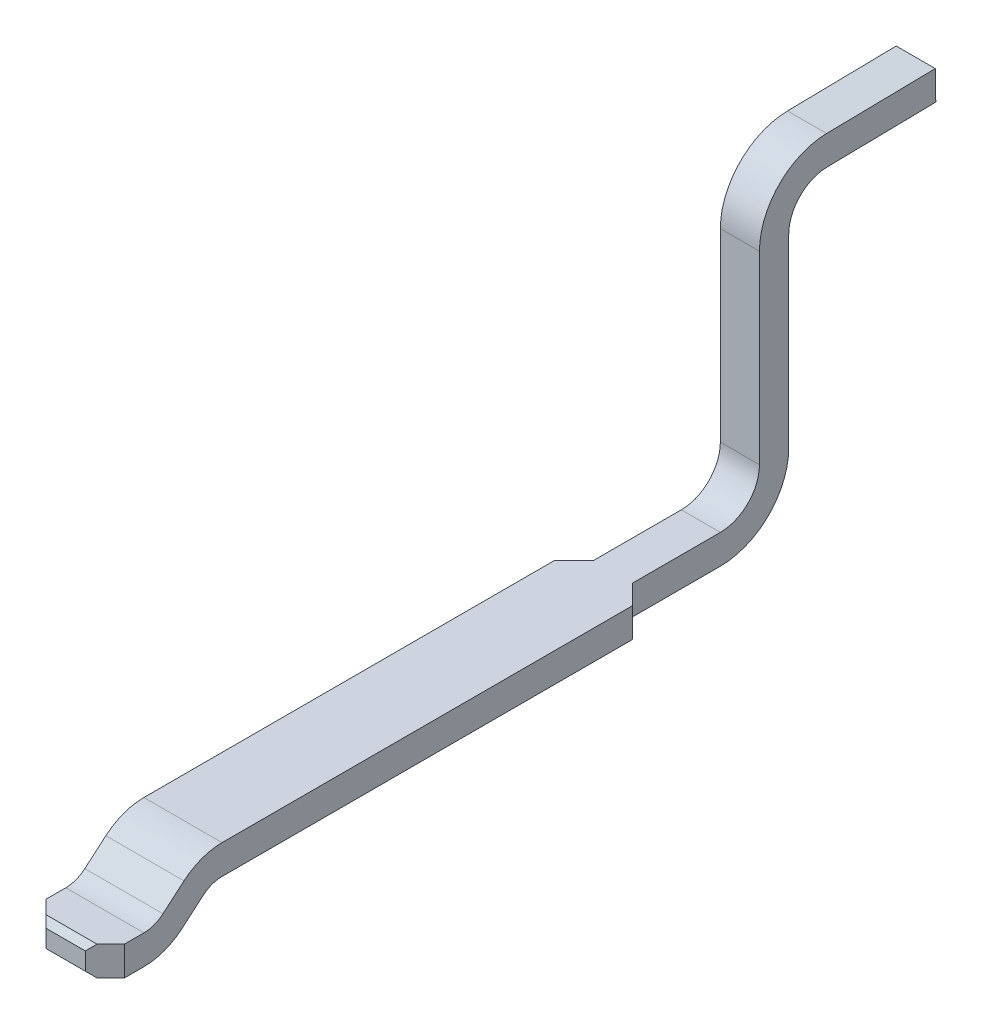
ISO-10303-21;
HEADER;
FILE_DESCRIPTION(('STEP AP214'),'2;1');
FILE_NAME('part.step','',(''),(''),'','','');
FILE_SCHEMA(('AUTOMOTIVE_DESIGN { 1 0 10303 214 1 1 1 1 }'));
ENDSEC;
DATA;
#1=APPLICATION_CONTEXT('core data for automotive mechanical design processes');
#2=APPLICATION_PROTOCOL_DEFINITION('international standard','automotive_design',2000,#1);
#3=PRODUCT_CONTEXT('',#1,'mechanical');
#4=PRODUCT('Part','Part','',(#3));
#5=PRODUCT_RELATED_PRODUCT_CATEGORY('part','',(#4));
#6=PRODUCT_DEFINITION_FORMATION('','',#4);
#7=PRODUCT_DEFINITION_CONTEXT('part definition',#1,'design');
#8=PRODUCT_DEFINITION('design','',#6,#7);
#9=PRODUCT_DEFINITION_SHAPE('','',#8);
#10=(LENGTH_UNIT() NAMED_UNIT(*) SI_UNIT(.MILLI.,.METRE.));
#11=(NAMED_UNIT(*) PLANE_ANGLE_UNIT() SI_UNIT($,.RADIAN.));
#12=(NAMED_UNIT(*) SI_UNIT($,.STERADIAN.) SOLID_ANGLE_UNIT());
#13=UNCERTAINTY_MEASURE_WITH_UNIT(LENGTH_MEASURE(1.E-05),#10,'distance_accuracy_value','');
#14=(GEOMETRIC_REPRESENTATION_CONTEXT(3) GLOBAL_UNCERTAINTY_ASSIGNED_CONTEXT((#13)) GLOBAL_UNIT_ASSIGNED_CONTEXT((#10,
#11,#12)) REPRESENTATION_CONTEXT('',''));
#15=CARTESIAN_POINT('',(0.,0.,0.));
#16=DIRECTION('',(0.,0.,1.));
#17=DIRECTION('',(1.,0.,0.));
#18=AXIS2_PLACEMENT_3D('',#15,#16,#17);
#19=CARTESIAN_POINT('',(2.50403496496787,8.074228109921,4.324047830079));
#20=DIRECTION('',(0.,0.707106781186548,0.707106781186548));
#21=DIRECTION('',(0.,-0.707106781186548,0.707106781186548));
#22=AXIS2_PLACEMENT_3D('',#19,#20,#21);
#23=PLANE('',#22);
#24=DIRECTION('',(-0.577350269190038,0.577350269189612,-0.577350269189228));
#25=VECTOR('',#24,1.);
#26=CARTESIAN_POINT('',(2.53973309999994,8.04019892,4.35807701999993));
#27=LINE('',#26,#25);
#28=CARTESIAN_POINT('',(2.53973309999992,8.04019892,4.35807701999995));
#29=VERTEX_POINT('',#28);
#30=CARTESIAN_POINT('',(2.50973309999989,8.07019892,4.32807701999998));
#31=VERTEX_POINT('',#30);
#32=EDGE_CURVE('E279',#29,#31,#27,.T.);
#33=ORIENTED_EDGE('',*,*,#32,.F.);
#34=DIRECTION('',(-1.,0.,0.));
#35=VECTOR('',#34,1.);
#36=CARTESIAN_POINT('',(2.74543123503187,8.04019892,4.35807702));
#37=LINE('',#36,#35);
#38=CARTESIAN_POINT('',(2.73973309999986,8.04019892,4.35807701999999));
#39=VERTEX_POINT('',#38);
#40=EDGE_CURVE('E356',#29,#39,#37,.F.);
#41=ORIENTED_EDGE('',*,*,#40,.T.);
#42=DIRECTION('',(-0.577350269190038,-0.577350269189604,0.577350269189236));
#43=VECTOR('',#42,1.);
#44=CARTESIAN_POINT('',(2.76973309999988,8.07019892,4.32807702000001));
#45=LINE('',#44,#43);
#46=CARTESIAN_POINT('',(2.76973309999988,8.07019892,4.32807702000001));
#47=VERTEX_POINT('',#46);
#48=EDGE_CURVE('E269',#47,#39,#45,.T.);
#49=ORIENTED_EDGE('',*,*,#48,.F.);
#50=DIRECTION('',(1.,0.,0.));
#51=VECTOR('',#50,1.);
#52=CARTESIAN_POINT('',(2.84773309999987,8.07019892,4.32807702));
#53=LINE('',#52,#51);
#54=EDGE_CURVE('E276',#31,#47,#53,.T.);
#55=ORIENTED_EDGE('',*,*,#54,.F.);
#56=EDGE_LOOP('',(#33,#41,#49,#55));
#57=FACE_BOUND('',#56,.T.);
#58=ADVANCED_FACE('F17',(#57),#23,.T.);
#59=CARTESIAN_POINT('',(2.74543123503187,7.944500784968,4.35807702));
#60=DIRECTION('',(0.,0.,-1.));
#61=DIRECTION('',(-1.,0.,0.));
#62=AXIS2_PLACEMENT_3D('',#59,#60,#61);
#63=PLANE('',#62);
#64=DIRECTION('',(0.,1.,0.));
#65=VECTOR('',#64,1.);
#66=CARTESIAN_POINT('',(2.73973309999986,7.914500784968,4.35807701999999));
#67=LINE('',#66,#65);
#68=CARTESIAN_POINT('',(2.73973309999986,7.95019892,4.35807701999999));
#69=VERTEX_POINT('',#68);
#70=EDGE_CURVE('E256',#39,#69,#67,.F.);
#71=ORIENTED_EDGE('',*,*,#70,.F.);
#72=ORIENTED_EDGE('',*,*,#40,.F.);
#73=DIRECTION('',(0.,1.,0.));
#74=VECTOR('',#73,1.);
#75=CARTESIAN_POINT('',(2.53973309999994,7.914500784968,4.35807701999993));
#76=LINE('',#75,#74);
#77=CARTESIAN_POINT('',(2.53973309999992,7.95019892,4.35807701999995));
#78=VERTEX_POINT('',#77);
#79=EDGE_CURVE('E338',#78,#29,#76,.T.);
#80=ORIENTED_EDGE('',*,*,#79,.F.);
#81=DIRECTION('',(1.,0.,0.));
#82=VECTOR('',#81,1.);
#83=CARTESIAN_POINT('',(2.77543123503187,7.95019892,4.35807702));
#84=LINE('',#83,#82);
#85=EDGE_CURVE('E331',#69,#78,#84,.F.);
#86=ORIENTED_EDGE('',*,*,#85,.F.);
#87=EDGE_LOOP('',(#71,#72,#80,#86));
#88=FACE_BOUND('',#87,.T.);
#89=ADVANCED_FACE('F775',(#88),#63,.F.);
#90=CARTESIAN_POINT('',(2.77543123503187,7.916169730079,4.324047830079));
#91=DIRECTION('',(0.,-0.707106781186548,0.707106781186548));
#92=DIRECTION('',(0.,-0.707106781186548,-0.707106781186548));
#93=AXIS2_PLACEMENT_3D('',#90,#91,#92);
#94=PLANE('',#93);
#95=DIRECTION('',(0.577350269190026,-0.577350269189626,-0.577350269189225));
#96=VECTOR('',#95,1.);
#97=CARTESIAN_POINT('',(2.73973309999986,7.95019892,4.35807701999999));
#98=LINE('',#97,#96);
#99=CARTESIAN_POINT('',(2.76973309999987,7.92019892,4.32807702));
#100=VERTEX_POINT('',#99);
#101=EDGE_CURVE('E270',#69,#100,#98,.T.);
#102=ORIENTED_EDGE('',*,*,#101,.F.);
#103=ORIENTED_EDGE('',*,*,#85,.T.);
#104=DIRECTION('',(0.577350269190026,0.577350269189634,0.577350269189217));
#105=VECTOR('',#104,1.);
#106=CARTESIAN_POINT('',(2.50973309999992,7.92019892,4.32807701999995));
#107=LINE('',#106,#105);
#108=CARTESIAN_POINT('',(2.50973309999989,7.92019892,4.32807701999998));
#109=VERTEX_POINT('',#108);
#110=EDGE_CURVE('E309',#109,#78,#107,.T.);
#111=ORIENTED_EDGE('',*,*,#110,.F.);
#112=DIRECTION('',(1.,0.,0.));
#113=VECTOR('',#112,1.);
#114=CARTESIAN_POINT('',(2.84773309999987,7.92019892,4.32807702));
#115=LINE('',#114,#113);
#116=EDGE_CURVE('E252',#109,#100,#115,.T.);
#117=ORIENTED_EDGE('',*,*,#116,.T.);
#118=EDGE_LOOP('',(#102,#103,#111,#117));
#119=FACE_BOUND('',#118,.T.);
#120=ADVANCED_FACE('F768',(#119),#94,.T.);
#121=CARTESIAN_POINT('',(2.74543123503187,8.45127780084181,0.758077020000001));
#122=DIRECTION('',(0.,0.,-1.));
#123=DIRECTION('',(-1.,0.,0.));
#124=AXIS2_PLACEMENT_3D('',#121,#122,#123);
#125=PLANE('',#124);
#126=DIRECTION('',(0.,1.,0.));
#127=VECTOR('',#126,1.);
#128=CARTESIAN_POINT('',(2.73973309999987,9.610333059471,0.758077020000001));
#129=LINE('',#128,#127);
#130=CARTESIAN_POINT('',(2.73973309999987,8.47019892,0.758077020000001));
#131=VERTEX_POINT('',#130);
#132=CARTESIAN_POINT('',(2.73973309999987,9.41625487791,0.758077020000001));
#133=VERTEX_POINT('',#132);
#134=EDGE_CURVE('E416',#131,#133,#129,.T.);
#135=ORIENTED_EDGE('',*,*,#134,.F.);
#136=DIRECTION('',(-1.,0.,0.));
#137=VECTOR('',#136,1.);
#138=CARTESIAN_POINT('',(2.73973309999987,8.47019892,0.75807702));
#139=LINE('',#138,#137);
#140=CARTESIAN_POINT('',(2.53973309999987,8.47019892,0.758077020000001));
#141=VERTEX_POINT('',#140);
#142=EDGE_CURVE('E213',#141,#131,#139,.F.);
#143=ORIENTED_EDGE('',*,*,#142,.F.);
#144=DIRECTION('',(0.,1.,0.));
#145=VECTOR('',#144,1.);
#146=CARTESIAN_POINT('',(2.53973309999987,8.45127780084181,0.758077020000001));
#147=LINE('',#146,#145);
#148=CARTESIAN_POINT('',(2.53973309999987,9.41625487791,0.758077020000001));
#149=VERTEX_POINT('',#148);
#150=EDGE_CURVE('E412',#149,#141,#147,.F.);
#151=ORIENTED_EDGE('',*,*,#150,.F.);
#152=DIRECTION('',(1.,0.,0.));
#153=VECTOR('',#152,1.);
#154=CARTESIAN_POINT('',(2.53973309999987,9.41625487791,0.758077020000001));
#155=LINE('',#154,#153);
#156=EDGE_CURVE('E306',#149,#133,#155,.T.);
#157=ORIENTED_EDGE('',*,*,#156,.T.);
#158=EDGE_LOOP('',(#135,#143,#151,#157));
#159=FACE_BOUND('',#158,.T.);
#160=ADVANCED_FACE('F579',(#159),#125,.T.);
#161=CARTESIAN_POINT('',(2.73973309999987,8.47019892,1.10807702));
#162=DIRECTION('',(-1.,0.,0.));
#163=DIRECTION('',(0.,0.,1.));
#164=AXIS2_PLACEMENT_3D('',#161,#162,#163);
#165=CYLINDRICAL_SURFACE('',#164,0.35);
#166=DIRECTION('',(1.,0.,0.));
#167=VECTOR('',#166,1.);
#168=CARTESIAN_POINT('',(2.84773309999987,8.12019892,1.10807702));
#169=LINE('',#168,#167);
#170=CARTESIAN_POINT('',(2.73973309999987,8.12019892,1.10807702));
#171=VERTEX_POINT('',#170);
#172=CARTESIAN_POINT('',(2.53973309999987,8.12019892,1.10807702));
#173=VERTEX_POINT('',#172);
#174=EDGE_CURVE('E229',#171,#173,#169,.F.);
#175=ORIENTED_EDGE('',*,*,#174,.T.);
#176=CARTESIAN_POINT('',(2.53973309999987,8.47019892,1.10807702));
#177=DIRECTION('',(-1.,0.,0.));
#178=DIRECTION('',(0.,0.,1.));
#179=AXIS2_PLACEMENT_3D('',#176,#177,#178);
#180=CIRCLE('',#179,0.35);
#181=EDGE_CURVE('E409',#141,#173,#180,.T.);
#182=ORIENTED_EDGE('',*,*,#181,.F.);
#183=ORIENTED_EDGE('',*,*,#142,.T.);
#184=CARTESIAN_POINT('',(2.73973309999987,8.47019892,1.10807702));
#185=DIRECTION('',(-1.,0.,0.));
#186=DIRECTION('',(0.,0.,1.));
#187=AXIS2_PLACEMENT_3D('',#184,#185,#186);
#188=CIRCLE('',#187,0.35);
#189=EDGE_CURVE('E417',#171,#131,#188,.F.);
#190=ORIENTED_EDGE('',*,*,#189,.F.);
#191=EDGE_LOOP('',(#175,#182,#183,#190));
#192=FACE_BOUND('',#191,.T.);
#193=ADVANCED_FACE('F576',(#192),#165,.T.);
#194=CARTESIAN_POINT('',(2.74543123503187,8.45127780084181,0.908077020000001));
#195=DIRECTION('',(0.,0.,-1.));
#196=DIRECTION('',(-1.,0.,0.));
#197=AXIS2_PLACEMENT_3D('',#194,#195,#196);
#198=PLANE('',#197);
#199=DIRECTION('',(-1.,0.,0.));
#200=VECTOR('',#199,1.);
#201=CARTESIAN_POINT('',(2.73973309999987,8.47019892,0.90807702));
#202=LINE('',#201,#200);
#203=CARTESIAN_POINT('',(2.53973309999987,8.47019892,0.908077020000001));
#204=VERTEX_POINT('',#203);
#205=CARTESIAN_POINT('',(2.73973309999987,8.47019892,0.908077020000001));
#206=VERTEX_POINT('',#205);
#207=EDGE_CURVE('E218',#204,#206,#202,.F.);
#208=ORIENTED_EDGE('',*,*,#207,.T.);
#209=DIRECTION('',(0.,1.,0.));
#210=VECTOR('',#209,1.);
#211=CARTESIAN_POINT('',(2.73973309999987,9.610333059471,0.908077020000001));
#212=LINE('',#211,#210);
#213=CARTESIAN_POINT('',(2.73973309999987,9.41625487791,0.908077020000001));
#214=VERTEX_POINT('',#213);
#215=EDGE_CURVE('E216',#214,#206,#212,.F.);
#216=ORIENTED_EDGE('',*,*,#215,.F.);
#217=DIRECTION('',(1.,0.,0.));
#218=VECTOR('',#217,1.);
#219=CARTESIAN_POINT('',(2.53973309999987,9.41625487791,0.908077020000001));
#220=LINE('',#219,#218);
#221=CARTESIAN_POINT('',(2.53973309999987,9.41625487791,0.908077020000001));
#222=VERTEX_POINT('',#221);
#223=EDGE_CURVE('E203',#222,#214,#220,.T.);
#224=ORIENTED_EDGE('',*,*,#223,.F.);
#225=DIRECTION('',(0.,1.,0.));
#226=VECTOR('',#225,1.);
#227=CARTESIAN_POINT('',(2.53973309999987,8.45127780084181,0.908077020000001));
#228=LINE('',#227,#226);
#229=EDGE_CURVE('E404',#204,#222,#228,.T.);
#230=ORIENTED_EDGE('',*,*,#229,.F.);
#231=EDGE_LOOP('',(#208,#216,#224,#230));
#232=FACE_BOUND('',#231,.T.);
#233=ADVANCED_FACE('F217',(#232),#198,.F.);
#234=CARTESIAN_POINT('',(2.53973309999987,9.41625487791,0.558077020000001));
#235=DIRECTION('',(1.,0.,0.));
#236=DIRECTION('',(0.,0.,-1.));
#237=AXIS2_PLACEMENT_3D('',#234,#235,#236);
#238=CYLINDRICAL_SURFACE('',#237,0.35);
#239=ORIENTED_EDGE('',*,*,#223,.T.);
#240=CARTESIAN_POINT('',(2.73973309999987,9.41625487791,0.558077020000001));
#241=DIRECTION('',(1.,0.,0.));
#242=DIRECTION('',(0.,0.,-1.));
#243=AXIS2_PLACEMENT_3D('',#240,#241,#242);
#244=CIRCLE('',#243,0.35);
#245=CARTESIAN_POINT('',(2.73973309999987,9.76620157121429,0.564185362253241));
#246=VERTEX_POINT('',#245);
#247=EDGE_CURVE('E20',#246,#214,#244,.T.);
#248=ORIENTED_EDGE('',*,*,#247,.F.);
#249=DIRECTION('',(1.,0.,0.));
#250=VECTOR('',#249,1.);
#251=CARTESIAN_POINT('',(2.53403496496787,9.76620157121458,0.564185362253011));
#252=LINE('',#251,#250);
#253=CARTESIAN_POINT('',(2.53973309999987,9.76620157121429,0.564185362253241));
#254=VERTEX_POINT('',#253);
#255=EDGE_CURVE('E198',#254,#246,#252,.T.);
#256=ORIENTED_EDGE('',*,*,#255,.F.);
#257=CARTESIAN_POINT('',(2.53973309999987,9.41625487791,0.558077020000001));
#258=DIRECTION('',(1.,0.,0.));
#259=DIRECTION('',(0.,0.,-1.));
#260=AXIS2_PLACEMENT_3D('',#257,#258,#259);
#261=CIRCLE('',#260,0.35);
#262=EDGE_CURVE('E209',#222,#254,#261,.F.);
#263=ORIENTED_EDGE('',*,*,#262,.F.);
#264=EDGE_LOOP('',(#239,#248,#256,#263));
#265=FACE_BOUND('',#264,.T.);
#266=ADVANCED_FACE('F205',(#265),#238,.T.);
#267=CARTESIAN_POINT('',(2.53403496496787,9.766007480923,0.575304787611001));
#268=DIRECTION('',(0.,0.999847695156406,0.0174524064364471));
#269=DIRECTION('',(0.,-0.0174524064364471,0.999847695156406));
#270=AXIS2_PLACEMENT_3D('',#267,#268,#269);
#271=PLANE('',#270);
#272=DIRECTION('',(0.,0.0174524064385203,-0.99984769515637));
#273=VECTOR('',#272,1.);
#274=CARTESIAN_POINT('',(2.53973309999987,9.766201571214,0.564185362253001));
#275=LINE('',#274,#273);
#276=CARTESIAN_POINT('',(2.53973309999987,9.775906085794,0.00821409435916126));
#277=VERTEX_POINT('',#276);
#278=EDGE_CURVE('E318',#254,#277,#275,.T.);
#279=ORIENTED_EDGE('',*,*,#278,.F.);
#280=ORIENTED_EDGE('',*,*,#255,.T.);
#281=DIRECTION('',(0.,-0.0174524064385203,0.99984769515637));
#282=VECTOR('',#281,1.);
#283=CARTESIAN_POINT('',(2.73973309999987,9.775906085794,0.00821409435900074));
#284=LINE('',#283,#282);
#285=CARTESIAN_POINT('',(2.73973309999987,9.775906085794,0.00821409435916126));
#286=VERTEX_POINT('',#285);
#287=EDGE_CURVE('E226',#286,#246,#284,.T.);
#288=ORIENTED_EDGE('',*,*,#287,.F.);
#289=DIRECTION('',(1.,0.,0.));
#290=VECTOR('',#289,1.);
#291=CARTESIAN_POINT('',(2.74543123503187,9.77590608579399,0.0082140943594823));
#292=LINE('',#291,#290);
#293=EDGE_CURVE('E311',#277,#286,#292,.T.);
#294=ORIENTED_EDGE('',*,*,#293,.F.);
#295=EDGE_LOOP('',(#279,#280,#288,#294));
#296=FACE_BOUND('',#295,.T.);
#297=ADVANCED_FACE('F593',(#296),#271,.T.);
#298=CARTESIAN_POINT('',(2.74543123503187,9.620231664342,0.00549678722500089));
#299=DIRECTION('',(0.,0.0174524064396861,-0.999847695156349));
#300=DIRECTION('',(0.,0.999847695156349,0.0174524064396861));
#301=AXIS2_PLACEMENT_3D('',#298,#299,#300);
#302=PLANE('',#301);
#303=DIRECTION('',(1.,0.,0.));
#304=VECTOR('',#303,1.);
#305=CARTESIAN_POINT('',(2.53403496496787,9.62592893152041,0.00559623339400797));
#306=LINE('',#305,#304);
#307=CARTESIAN_POINT('',(2.73973309999987,9.62592893152018,0.00559623339400417));
#308=VERTEX_POINT('',#307);
#309=CARTESIAN_POINT('',(2.53973309999987,9.62592893152014,0.00559623339400334));
#310=VERTEX_POINT('',#309);
#311=EDGE_CURVE('E307',#308,#310,#306,.F.);
#312=ORIENTED_EDGE('',*,*,#311,.T.);
#313=DIRECTION('',(0.,-0.999847695156461,-0.0174524064332696));
#314=VECTOR('',#313,1.);
#315=CARTESIAN_POINT('',(2.53973309999987,9.775906085794,0.00821409435900074));
#316=LINE('',#315,#314);
#317=EDGE_CURVE('E314',#277,#310,#316,.T.);
#318=ORIENTED_EDGE('',*,*,#317,.F.);
#319=ORIENTED_EDGE('',*,*,#293,.T.);
#320=DIRECTION('',(0.,0.999847695156461,0.0174524064332696));
#321=VECTOR('',#320,1.);
#322=CARTESIAN_POINT('',(2.73973309999987,9.62592893152,0.00559623339400103));
#323=LINE('',#322,#321);
#324=EDGE_CURVE('E328',#308,#286,#323,.T.);
#325=ORIENTED_EDGE('',*,*,#324,.F.);
#326=EDGE_LOOP('',(#312,#318,#319,#325));
#327=FACE_BOUND('',#326,.T.);
#328=ADVANCED_FACE('F592',(#327),#302,.T.);
#329=CARTESIAN_POINT('',(2.53403496496787,9.616030326649,0.572686926645001));
#330=DIRECTION('',(0.,0.999847695156375,0.0174524064382066));
#331=DIRECTION('',(0.,-0.0174524064382066,0.999847695156375));
#332=AXIS2_PLACEMENT_3D('',#329,#330,#331);
#333=PLANE('',#332);
#334=DIRECTION('',(1.,0.,0.));
#335=VECTOR('',#334,1.);
#336=CARTESIAN_POINT('',(2.53973309999987,9.61622441694128,0.561567501287006));
#337=LINE('',#336,#335);
#338=CARTESIAN_POINT('',(2.73973309999987,9.61622441694114,0.561567501287176));
#339=VERTEX_POINT('',#338);
#340=CARTESIAN_POINT('',(2.53973309999987,9.61622441694114,0.561567501287176));
#341=VERTEX_POINT('',#340);
#342=EDGE_CURVE('E304',#339,#341,#337,.F.);
#343=ORIENTED_EDGE('',*,*,#342,.T.);
#344=DIRECTION('',(0.,-0.0174524064367521,0.999847695156401));
#345=VECTOR('',#344,1.);
#346=CARTESIAN_POINT('',(2.53973309999987,9.62592893152,0.00559623339400103));
#347=LINE('',#346,#345);
#348=EDGE_CURVE('E317',#310,#341,#347,.T.);
#349=ORIENTED_EDGE('',*,*,#348,.F.);
#350=ORIENTED_EDGE('',*,*,#311,.F.);
#351=DIRECTION('',(0.,0.0174524064367521,-0.999847695156401));
#352=VECTOR('',#351,1.);
#353=CARTESIAN_POINT('',(2.73973309999987,9.616224416941,0.561567501287001));
#354=LINE('',#353,#352);
#355=EDGE_CURVE('E333',#339,#308,#354,.T.);
#356=ORIENTED_EDGE('',*,*,#355,.F.);
#357=EDGE_LOOP('',(#343,#349,#350,#356));
#358=FACE_BOUND('',#357,.T.);
#359=ADVANCED_FACE('F588',(#358),#333,.F.);
#360=CARTESIAN_POINT('',(2.53973309999987,9.41625487791,0.558077020000001));
#361=DIRECTION('',(1.,0.,0.));
#362=DIRECTION('',(0.,0.,-1.));
#363=AXIS2_PLACEMENT_3D('',#360,#361,#362);
#364=CYLINDRICAL_SURFACE('',#363,0.2);
#365=ORIENTED_EDGE('',*,*,#156,.F.);
#366=CARTESIAN_POINT('',(2.53973309999987,9.41625487791,0.558077020000001));
#367=DIRECTION('',(1.,0.,0.));
#368=DIRECTION('',(0.,0.,-1.));
#369=AXIS2_PLACEMENT_3D('',#366,#367,#368);
#370=CIRCLE('',#369,0.2);
#371=EDGE_CURVE('E400',#341,#149,#370,.T.);
#372=ORIENTED_EDGE('',*,*,#371,.F.);
#373=ORIENTED_EDGE('',*,*,#342,.F.);
#374=CARTESIAN_POINT('',(2.73973309999987,9.41625487791,0.558077020000001));
#375=DIRECTION('',(1.,0.,0.));
#376=DIRECTION('',(0.,0.,-1.));
#377=AXIS2_PLACEMENT_3D('',#374,#375,#376);
#378=CIRCLE('',#377,0.2);
#379=EDGE_CURVE('E414',#133,#339,#378,.F.);
#380=ORIENTED_EDGE('',*,*,#379,.F.);
#381=EDGE_LOOP('',(#365,#372,#373,#380));
#382=FACE_BOUND('',#381,.T.);
#383=ADVANCED_FACE('F584',(#382),#364,.F.);
#384=CARTESIAN_POINT('',(2.43570391007887,7.914500784968,4.254047830079));
#385=DIRECTION('',(-0.707106781186048,0.,0.707106781187048));
#386=DIRECTION('',(0.707106781187048,0.,0.707106781186048));
#387=AXIS2_PLACEMENT_3D('',#384,#385,#386);
#388=PLANE('',#387);
#389=DIRECTION('',(0.,1.,0.));
#390=VECTOR('',#389,1.);
#391=CARTESIAN_POINT('',(2.43973309999987,7.914500784968,4.25807702));
#392=LINE('',#391,#390);
#393=CARTESIAN_POINT('',(2.43973309999987,8.07019892,4.25807702));
#394=VERTEX_POINT('',#393);
#395=CARTESIAN_POINT('',(2.43973309999987,7.92019892,4.25807702));
#396=VERTEX_POINT('',#395);
#397=EDGE_CURVE('E295',#394,#396,#392,.F.);
#398=ORIENTED_EDGE('',*,*,#397,.T.);
#399=DIRECTION('',(0.707106781186543,0.,0.707106781186552));
#400=VECTOR('',#399,1.);
#401=CARTESIAN_POINT('',(2.43973309999987,7.92019892,4.25807702));
#402=LINE('',#401,#400);
#403=EDGE_CURVE('E255',#396,#109,#402,.T.);
#404=ORIENTED_EDGE('',*,*,#403,.T.);
#405=ORIENTED_EDGE('',*,*,#110,.T.);
#406=ORIENTED_EDGE('',*,*,#79,.T.);
#407=ORIENTED_EDGE('',*,*,#32,.T.);
#408=DIRECTION('',(0.707106781186543,0.,0.707106781186552));
#409=VECTOR('',#408,1.);
#410=CARTESIAN_POINT('',(2.43973309999987,8.07019892,4.25807702));
#411=LINE('',#410,#409);
#412=EDGE_CURVE('E275',#394,#31,#411,.T.);
#413=ORIENTED_EDGE('',*,*,#412,.F.);
#414=EDGE_LOOP('',(#398,#404,#405,#406,#407,#413));
#415=FACE_BOUND('',#414,.T.);
#416=ADVANCED_FACE('F712',(#415),#388,.T.);
#417=CARTESIAN_POINT('',(2.84773309999987,8.102515836027,4.064893542443));
#418=DIRECTION('',(0.,0.759858617954068,0.650088363779058));
#419=DIRECTION('',(0.,-0.650088363779058,0.759858617954068));
#420=AXIS2_PLACEMENT_3D('',#417,#418,#419);
#421=PLANE('',#420);
#422=DIRECTION('',(0.,-0.650088363774947,0.759858617957586));
#423=VECTOR('',#422,1.);
#424=CARTESIAN_POINT('',(2.43973309999987,8.198156505386,3.953103529133));
#425=LINE('',#424,#423);
#426=CARTESIAN_POINT('',(2.43973309999987,8.19815650538664,3.95310352913274));
#427=VERTEX_POINT('',#426);
#428=CARTESIAN_POINT('',(2.43973309999987,8.10622012730668,4.06056376543338));
#429=VERTEX_POINT('',#428);
#430=EDGE_CURVE('E393',#427,#429,#425,.T.);
#431=ORIENTED_EDGE('',*,*,#430,.T.);
#432=DIRECTION('',(-1.,0.,0.));
#433=VECTOR('',#432,1.);
#434=CARTESIAN_POINT('',(2.83973309999987,8.10622012730701,4.06056376543301));
#435=LINE('',#434,#433);
#436=CARTESIAN_POINT('',(2.83973309999987,8.10622012730668,4.06056376543338));
#437=VERTEX_POINT('',#436);
#438=EDGE_CURVE('E277',#429,#437,#435,.F.);
#439=ORIENTED_EDGE('',*,*,#438,.T.);
#440=DIRECTION('',(0.,-0.650088363774947,0.759858617957586));
#441=VECTOR('',#440,1.);
#442=CARTESIAN_POINT('',(2.83973309999987,8.198156505386,3.953103529133));
#443=LINE('',#442,#441);
#444=CARTESIAN_POINT('',(2.83973309999987,8.19815650538664,3.95310352913274));
#445=VERTEX_POINT('',#444);
#446=EDGE_CURVE('E385',#445,#437,#443,.T.);
#447=ORIENTED_EDGE('',*,*,#446,.F.);
#448=DIRECTION('',(-1.,0.,0.));
#449=VECTOR('',#448,1.);
#450=CARTESIAN_POINT('',(2.83973309999987,8.19815650538648,3.95310352913341));
#451=LINE('',#450,#449);
#452=EDGE_CURVE('E280',#427,#445,#451,.F.);
#453=ORIENTED_EDGE('',*,*,#452,.F.);
#454=EDGE_LOOP('',(#431,#439,#447,#453));
#455=FACE_BOUND('',#454,.T.);
#456=ADVANCED_FACE('F528',(#455),#421,.T.);
#457=CARTESIAN_POINT('',(2.83973309999987,8.22019892,4.15807702));
#458=DIRECTION('',(-1.,0.,0.));
#459=DIRECTION('',(0.,0.,1.));
#460=AXIS2_PLACEMENT_3D('',#457,#458,#459);
#461=CYLINDRICAL_SURFACE('',#460,0.15);
#462=CARTESIAN_POINT('',(2.43973309999987,8.22019892,4.15807702));
#463=DIRECTION('',(-1.,0.,0.));
#464=DIRECTION('',(0.,0.,1.));
#465=AXIS2_PLACEMENT_3D('',#462,#463,#464);
#466=CIRCLE('',#465,0.15);
#467=CARTESIAN_POINT('',(2.43973309999987,8.07019892,4.15807702));
#468=VERTEX_POINT('',#467);
#469=EDGE_CURVE('E390',#429,#468,#466,.T.);
#470=ORIENTED_EDGE('',*,*,#469,.T.);
#471=DIRECTION('',(1.,0.,0.));
#472=VECTOR('',#471,1.);
#473=CARTESIAN_POINT('',(2.84773309999987,8.07019892,4.15807702));
#474=LINE('',#473,#472);
#475=CARTESIAN_POINT('',(2.83973309999987,8.07019892,4.15807702));
#476=VERTEX_POINT('',#475);
#477=EDGE_CURVE('E273',#476,#468,#474,.F.);
#478=ORIENTED_EDGE('',*,*,#477,.F.);
#479=CARTESIAN_POINT('',(2.83973309999987,8.22019892,4.15807702));
#480=DIRECTION('',(-1.,0.,0.));
#481=DIRECTION('',(0.,0.,1.));
#482=AXIS2_PLACEMENT_3D('',#479,#480,#481);
#483=CIRCLE('',#482,0.15);
#484=EDGE_CURVE('E382',#437,#476,#483,.T.);
#485=ORIENTED_EDGE('',*,*,#484,.F.);
#486=ORIENTED_EDGE('',*,*,#438,.F.);
#487=EDGE_LOOP('',(#470,#478,#485,#486));
#488=FACE_BOUND('',#487,.T.);
#489=ADVANCED_FACE('F533',(#488),#461,.F.);
#490=CARTESIAN_POINT('',(2.84773309999987,8.07019892,4.333775155032));
#491=DIRECTION('',(0.,1.,0.));
#492=DIRECTION('',(0.,0.,1.));
#493=AXIS2_PLACEMENT_3D('',#490,#491,#492);
#494=PLANE('',#493);
#495=DIRECTION('',(0.,0.,-1.));
#496=VECTOR('',#495,1.);
#497=CARTESIAN_POINT('',(2.43973309999987,8.07019892,4.163775155032));
#498=LINE('',#497,#496);
#499=EDGE_CURVE('E287',#468,#394,#498,.F.);
#500=ORIENTED_EDGE('',*,*,#499,.T.);
#501=ORIENTED_EDGE('',*,*,#412,.T.);
#502=ORIENTED_EDGE('',*,*,#54,.T.);
#503=DIRECTION('',(0.707106781187048,0.,-0.707106781186048));
#504=VECTOR('',#503,1.);
#505=CARTESIAN_POINT('',(2.73570391007884,8.07019892,4.362106209921));
#506=LINE('',#505,#504);
#507=CARTESIAN_POINT('',(2.83973309999989,8.07019892,4.25807702000002));
#508=VERTEX_POINT('',#507);
#509=EDGE_CURVE('E266',#508,#47,#506,.F.);
#510=ORIENTED_EDGE('',*,*,#509,.F.);
#511=DIRECTION('',(0.,0.,-1.));
#512=VECTOR('',#511,1.);
#513=CARTESIAN_POINT('',(2.83973309999987,8.07019892,3.80007702));
#514=LINE('',#513,#512);
#515=EDGE_CURVE('E263',#476,#508,#514,.F.);
#516=ORIENTED_EDGE('',*,*,#515,.F.);
#517=ORIENTED_EDGE('',*,*,#477,.T.);
#518=EDGE_LOOP('',(#500,#501,#502,#510,#516,#517));
#519=FACE_BOUND('',#518,.T.);
#520=ADVANCED_FACE('F537',(#519),#494,.T.);
#521=CARTESIAN_POINT('',(2.73570391007884,7.914500784968,4.362106209921));
#522=DIRECTION('',(0.707106781186048,0.,0.707106781187048));
#523=DIRECTION('',(0.707106781187048,0.,-0.707106781186048));
#524=AXIS2_PLACEMENT_3D('',#521,#522,#523);
#525=PLANE('',#524);
#526=ORIENTED_EDGE('',*,*,#48,.T.);
#527=ORIENTED_EDGE('',*,*,#70,.T.);
#528=ORIENTED_EDGE('',*,*,#101,.T.);
#529=DIRECTION('',(0.707106781186543,0.,-0.707106781186552));
#530=VECTOR('',#529,1.);
#531=CARTESIAN_POINT('',(2.76973309999987,7.92019892,4.32807702));
#532=LINE('',#531,#530);
#533=CARTESIAN_POINT('',(2.83973309999987,7.92019892,4.25807702));
#534=VERTEX_POINT('',#533);
#535=EDGE_CURVE('E253',#100,#534,#532,.T.);
#536=ORIENTED_EDGE('',*,*,#535,.T.);
#537=DIRECTION('',(0.,1.,0.));
#538=VECTOR('',#537,1.);
#539=CARTESIAN_POINT('',(2.83973309999987,8.114500784968,4.25807702));
#540=LINE('',#539,#538);
#541=EDGE_CURVE('E259',#508,#534,#540,.F.);
#542=ORIENTED_EDGE('',*,*,#541,.F.);
#543=ORIENTED_EDGE('',*,*,#509,.T.);
#544=EDGE_LOOP('',(#526,#527,#528,#536,#542,#543));
#545=FACE_BOUND('',#544,.T.);
#546=ADVANCED_FACE('F540',(#545),#525,.T.);
#547=CARTESIAN_POINT('',(2.84773309999987,7.92019892,4.333775155032));
#548=DIRECTION('',(0.,1.,0.));
#549=DIRECTION('',(0.,0.,1.));
#550=AXIS2_PLACEMENT_3D('',#547,#548,#549);
#551=PLANE('',#550);
#552=ORIENTED_EDGE('',*,*,#403,.F.);
#553=DIRECTION('',(0.,0.,-1.));
#554=VECTOR('',#553,1.);
#555=CARTESIAN_POINT('',(2.43973309999987,7.92019892,4.163775155032));
#556=LINE('',#555,#554);
#557=CARTESIAN_POINT('',(2.43973309999987,7.92019892,4.15807702));
#558=VERTEX_POINT('',#557);
#559=EDGE_CURVE('E297',#396,#558,#556,.T.);
#560=ORIENTED_EDGE('',*,*,#559,.T.);
#561=DIRECTION('',(-1.,0.,0.));
#562=VECTOR('',#561,1.);
#563=CARTESIAN_POINT('',(2.83973309999987,7.92019892,4.15807702));
#564=LINE('',#563,#562);
#565=CARTESIAN_POINT('',(2.83973309999987,7.92019892,4.15807702));
#566=VERTEX_POINT('',#565);
#567=EDGE_CURVE('E249',#566,#558,#564,.T.);
#568=ORIENTED_EDGE('',*,*,#567,.F.);
#569=DIRECTION('',(0.,0.,-1.));
#570=VECTOR('',#569,1.);
#571=CARTESIAN_POINT('',(2.83973309999987,7.92019892,3.80007702));
#572=LINE('',#571,#570);
#573=EDGE_CURVE('E262',#534,#566,#572,.T.);
#574=ORIENTED_EDGE('',*,*,#573,.F.);
#575=ORIENTED_EDGE('',*,*,#535,.F.);
#576=ORIENTED_EDGE('',*,*,#116,.F.);
#577=EDGE_LOOP('',(#552,#560,#568,#574,#575,#576));
#578=FACE_BOUND('',#577,.T.);
#579=ADVANCED_FACE('F547',(#578),#551,.F.);
#580=CARTESIAN_POINT('',(2.83973309999987,8.22019892,4.15807702));
#581=DIRECTION('',(-1.,0.,0.));
#582=DIRECTION('',(0.,0.,1.));
#583=AXIS2_PLACEMENT_3D('',#580,#581,#582);
#584=CYLINDRICAL_SURFACE('',#583,0.3);
#585=CARTESIAN_POINT('',(2.43973309999987,8.22019892,4.15807702));
#586=DIRECTION('',(-1.,0.,0.));
#587=DIRECTION('',(0.,0.,1.));
#588=AXIS2_PLACEMENT_3D('',#585,#586,#587);
#589=CIRCLE('',#588,0.3);
#590=CARTESIAN_POINT('',(2.43973309999987,7.99224133461339,3.96305051086728));
#591=VERTEX_POINT('',#590);
#592=EDGE_CURVE('E398',#558,#591,#589,.F.);
#593=ORIENTED_EDGE('',*,*,#592,.T.);
#594=DIRECTION('',(1.,0.,0.));
#595=VECTOR('',#594,1.);
#596=CARTESIAN_POINT('',(2.84773309999987,7.99224133461357,3.96305051086664));
#597=LINE('',#596,#595);
#598=CARTESIAN_POINT('',(2.83973309999987,7.99224133461339,3.96305051086728));
#599=VERTEX_POINT('',#598);
#600=EDGE_CURVE('E247',#591,#599,#597,.T.);
#601=ORIENTED_EDGE('',*,*,#600,.T.);
#602=CARTESIAN_POINT('',(2.83973309999987,8.22019892,4.15807702));
#603=DIRECTION('',(-1.,0.,0.));
#604=DIRECTION('',(0.,0.,1.));
#605=AXIS2_PLACEMENT_3D('',#602,#603,#604);
#606=CIRCLE('',#605,0.3);
#607=EDGE_CURVE('E379',#566,#599,#606,.F.);
#608=ORIENTED_EDGE('',*,*,#607,.F.);
#609=ORIENTED_EDGE('',*,*,#567,.T.);
#610=EDGE_LOOP('',(#593,#601,#608,#609));
#611=FACE_BOUND('',#610,.T.);
#612=ADVANCED_FACE('F551',(#611),#584,.T.);
#613=CARTESIAN_POINT('',(2.84773309999987,7.988537043334,3.967380287877));
#614=DIRECTION('',(0.,0.759858617954068,0.650088363779058));
#615=DIRECTION('',(0.,-0.650088363779058,0.759858617954068));
#616=AXIS2_PLACEMENT_3D('',#613,#614,#615);
#617=PLANE('',#616);
#618=ORIENTED_EDGE('',*,*,#600,.F.);
#619=DIRECTION('',(0.,0.650088363774937,-0.759858617957595));
#620=VECTOR('',#619,1.);
#621=CARTESIAN_POINT('',(2.43973309999987,7.992241334614,3.963050510867));
#622=LINE('',#621,#620);
#623=CARTESIAN_POINT('',(2.43973309999987,8.08417771269332,3.85559027456662));
#624=VERTEX_POINT('',#623);
#625=EDGE_CURVE('E397',#591,#624,#622,.T.);
#626=ORIENTED_EDGE('',*,*,#625,.T.);
#627=DIRECTION('',(-1.,0.,0.));
#628=VECTOR('',#627,1.);
#629=CARTESIAN_POINT('',(2.83973309999987,8.08417771269299,3.85559027456699));
#630=LINE('',#629,#628);
#631=CARTESIAN_POINT('',(2.83973309999987,8.08417771269332,3.85559027456662));
#632=VERTEX_POINT('',#631);
#633=EDGE_CURVE('E243',#624,#632,#630,.F.);
#634=ORIENTED_EDGE('',*,*,#633,.T.);
#635=DIRECTION('',(0.,0.650088363774937,-0.759858617957595));
#636=VECTOR('',#635,1.);
#637=CARTESIAN_POINT('',(2.83973309999987,7.992241334614,3.963050510867));
#638=LINE('',#637,#636);
#639=EDGE_CURVE('E378',#599,#632,#638,.T.);
#640=ORIENTED_EDGE('',*,*,#639,.F.);
#641=EDGE_LOOP('',(#618,#626,#634,#640));
#642=FACE_BOUND('',#641,.T.);
#643=ADVANCED_FACE('F556',(#642),#617,.F.);
#644=CARTESIAN_POINT('',(2.83973309999987,7.97019892,3.75807702));
#645=DIRECTION('',(-1.,0.,0.));
#646=DIRECTION('',(0.,0.,1.));
#647=AXIS2_PLACEMENT_3D('',#644,#645,#646);
#648=CYLINDRICAL_SURFACE('',#647,0.15);
#649=CARTESIAN_POINT('',(2.43973309999987,7.97019892,3.75807702));
#650=DIRECTION('',(-1.,0.,0.));
#651=DIRECTION('',(0.,0.,1.));
#652=AXIS2_PLACEMENT_3D('',#649,#650,#651);
#653=CIRCLE('',#652,0.15);
#654=CARTESIAN_POINT('',(2.43973309999987,8.12019892,3.75807702));
#655=VERTEX_POINT('',#654);
#656=EDGE_CURVE('E394',#624,#655,#653,.T.);
#657=ORIENTED_EDGE('',*,*,#656,.T.);
#658=DIRECTION('',(1.,0.,0.));
#659=VECTOR('',#658,1.);
#660=CARTESIAN_POINT('',(2.84773309999987,8.12019892,3.75807702));
#661=LINE('',#660,#659);
#662=CARTESIAN_POINT('',(2.83973309999987,8.12019892,3.75807702));
#663=VERTEX_POINT('',#662);
#664=EDGE_CURVE('E227',#655,#663,#661,.T.);
#665=ORIENTED_EDGE('',*,*,#664,.T.);
#666=CARTESIAN_POINT('',(2.83973309999987,7.97019892,3.75807702));
#667=DIRECTION('',(-1.,0.,0.));
#668=DIRECTION('',(0.,0.,1.));
#669=AXIS2_PLACEMENT_3D('',#666,#667,#668);
#670=CIRCLE('',#669,0.15);
#671=EDGE_CURVE('E374',#632,#663,#670,.T.);
#672=ORIENTED_EDGE('',*,*,#671,.F.);
#673=ORIENTED_EDGE('',*,*,#633,.F.);
#674=EDGE_LOOP('',(#657,#665,#672,#673));
#675=FACE_BOUND('',#674,.T.);
#676=ADVANCED_FACE('F560',(#675),#648,.F.);
#677=CARTESIAN_POINT('',(2.84773309999987,8.12019892,3.81107702));
#678=DIRECTION('',(0.,1.,0.));
#679=DIRECTION('',(0.,0.,1.));
#680=AXIS2_PLACEMENT_3D('',#677,#678,#679);
#681=PLANE('',#680);
#682=ORIENTED_EDGE('',*,*,#664,.F.);
#683=DIRECTION('',(0.,0.,-1.));
#684=VECTOR('',#683,1.);
#685=CARTESIAN_POINT('',(2.43973309999987,8.12019892,4.163775155032));
#686=LINE('',#685,#684);
#687=CARTESIAN_POINT('',(2.43973309999987,8.12019892,1.65807702));
#688=VERTEX_POINT('',#687);
#689=EDGE_CURVE('E396',#655,#688,#686,.T.);
#690=ORIENTED_EDGE('',*,*,#689,.T.);
#691=DIRECTION('',(-0.707106781187048,0.,0.707106781186048));
#692=VECTOR('',#691,1.);
#693=CARTESIAN_POINT('',(2.43570391007887,8.12019892,1.662106209921));
#694=LINE('',#693,#692);
#695=CARTESIAN_POINT('',(2.53973309999992,8.12019892,1.55807702000005));
#696=VERTEX_POINT('',#695);
#697=EDGE_CURVE('E284',#696,#688,#694,.T.);
#698=ORIENTED_EDGE('',*,*,#697,.F.);
#699=DIRECTION('',(0.,0.,1.));
#700=VECTOR('',#699,1.);
#701=CARTESIAN_POINT('',(2.53973309999987,8.12019892,0.913775155032));
#702=LINE('',#701,#700);
#703=EDGE_CURVE('E408',#173,#696,#702,.T.);
#704=ORIENTED_EDGE('',*,*,#703,.F.);
#705=ORIENTED_EDGE('',*,*,#174,.F.);
#706=DIRECTION('',(0.,0.,-1.));
#707=VECTOR('',#706,1.);
#708=CARTESIAN_POINT('',(2.73973309999987,8.12019892,0.572587480477));
#709=LINE('',#708,#707);
#710=CARTESIAN_POINT('',(2.73973309999987,8.12019892,1.55807702));
#711=VERTEX_POINT('',#710);
#712=EDGE_CURVE('E221',#711,#171,#709,.T.);
#713=ORIENTED_EDGE('',*,*,#712,.F.);
#714=DIRECTION('',(-0.707106781186549,0.,-0.707106781186546));
#715=VECTOR('',#714,1.);
#716=CARTESIAN_POINT('',(2.83973309999987,8.12019892,1.65807702));
#717=LINE('',#716,#715);
#718=CARTESIAN_POINT('',(2.83973309999989,8.12019892,1.65807701999998));
#719=VERTEX_POINT('',#718);
#720=EDGE_CURVE('E241',#719,#711,#717,.T.);
#721=ORIENTED_EDGE('',*,*,#720,.F.);
#722=DIRECTION('',(0.,0.,-1.));
#723=VECTOR('',#722,1.);
#724=CARTESIAN_POINT('',(2.83973309999987,8.12019892,3.80007702));
#725=LINE('',#724,#723);
#726=EDGE_CURVE('E377',#663,#719,#725,.T.);
#727=ORIENTED_EDGE('',*,*,#726,.F.);
#728=EDGE_LOOP('',(#682,#690,#698,#704,#705,#713,#721,#727));
#729=FACE_BOUND('',#728,.T.);
#730=ADVANCED_FACE('F562',(#729),#681,.F.);
#731=CARTESIAN_POINT('',(2.73973309999987,9.610333059471,0.572587480477));
#732=DIRECTION('',(1.,0.,0.));
#733=DIRECTION('',(0.,0.,-1.));
#734=AXIS2_PLACEMENT_3D('',#731,#732,#733);
#735=PLANE('',#734);
#736=ORIENTED_EDGE('',*,*,#355,.T.);
#737=ORIENTED_EDGE('',*,*,#324,.T.);
#738=ORIENTED_EDGE('',*,*,#287,.T.);
#739=ORIENTED_EDGE('',*,*,#247,.T.);
#740=ORIENTED_EDGE('',*,*,#215,.T.);
#741=CARTESIAN_POINT('',(2.73973309999987,8.47019892,1.10807702));
#742=DIRECTION('',(-1.,0.,0.));
#743=DIRECTION('',(0.,0.,1.));
#744=AXIS2_PLACEMENT_3D('',#741,#742,#743);
#745=CIRCLE('',#744,0.2);
#746=CARTESIAN_POINT('',(2.73973309999987,8.27019892,1.10807702));
#747=VERTEX_POINT('',#746);
#748=EDGE_CURVE('E327',#206,#747,#745,.T.);
#749=ORIENTED_EDGE('',*,*,#748,.T.);
#750=DIRECTION('',(0.,0.,1.));
#751=VECTOR('',#750,1.);
#752=CARTESIAN_POINT('',(2.73973309999987,8.27019892,3.81107702));
#753=LINE('',#752,#751);
#754=CARTESIAN_POINT('',(2.73973309999987,8.27019892,1.55807702000001));
#755=VERTEX_POINT('',#754);
#756=EDGE_CURVE('E238',#755,#747,#753,.F.);
#757=ORIENTED_EDGE('',*,*,#756,.F.);
#758=DIRECTION('',(0.,1.,0.));
#759=VECTOR('',#758,1.);
#760=CARTESIAN_POINT('',(2.73973309999986,8.275897055032,1.55807702000001));
#761=LINE('',#760,#759);
#762=EDGE_CURVE('E235',#711,#755,#761,.T.);
#763=ORIENTED_EDGE('',*,*,#762,.F.);
#764=ORIENTED_EDGE('',*,*,#712,.T.);
#765=ORIENTED_EDGE('',*,*,#189,.T.);
#766=ORIENTED_EDGE('',*,*,#134,.T.);
#767=ORIENTED_EDGE('',*,*,#379,.T.);
#768=EDGE_LOOP('',(#736,#737,#738,#739,#740,#749,#757,#763,#764,#765,#766,#767));
#769=FACE_BOUND('',#768,.T.);
#770=ADVANCED_FACE('F224',(#769),#735,.T.);
#771=CARTESIAN_POINT('',(2.73973309999987,8.47019892,1.10807702));
#772=DIRECTION('',(-1.,0.,0.));
#773=DIRECTION('',(0.,0.,1.));
#774=AXIS2_PLACEMENT_3D('',#771,#772,#773);
#775=CYLINDRICAL_SURFACE('',#774,0.2);
#776=DIRECTION('',(1.,0.,0.));
#777=VECTOR('',#776,1.);
#778=CARTESIAN_POINT('',(2.84773309999987,8.27019892,1.10807702));
#779=LINE('',#778,#777);
#780=CARTESIAN_POINT('',(2.53973309999987,8.27019892,1.10807702));
#781=VERTEX_POINT('',#780);
#782=EDGE_CURVE('E435',#747,#781,#779,.F.);
#783=ORIENTED_EDGE('',*,*,#782,.F.);
#784=ORIENTED_EDGE('',*,*,#748,.F.);
#785=ORIENTED_EDGE('',*,*,#207,.F.);
#786=CARTESIAN_POINT('',(2.53973309999987,8.47019892,1.10807702));
#787=DIRECTION('',(-1.,0.,0.));
#788=DIRECTION('',(0.,0.,1.));
#789=AXIS2_PLACEMENT_3D('',#786,#787,#788);
#790=CIRCLE('',#789,0.2);
#791=EDGE_CURVE('E405',#781,#204,#790,.F.);
#792=ORIENTED_EDGE('',*,*,#791,.F.);
#793=EDGE_LOOP('',(#783,#784,#785,#792));
#794=FACE_BOUND('',#793,.T.);
#795=ADVANCED_FACE('F597',(#794),#775,.F.);
#796=CARTESIAN_POINT('',(2.53973309999987,8.45127780084181,0.913775155032));
#797=DIRECTION('',(-1.,0.,0.));
#798=DIRECTION('',(0.,0.,1.));
#799=AXIS2_PLACEMENT_3D('',#796,#797,#798);
#800=PLANE('',#799);
#801=ORIENTED_EDGE('',*,*,#348,.T.);
#802=ORIENTED_EDGE('',*,*,#371,.T.);
#803=ORIENTED_EDGE('',*,*,#150,.T.);
#804=ORIENTED_EDGE('',*,*,#181,.T.);
#805=ORIENTED_EDGE('',*,*,#703,.T.);
#806=DIRECTION('',(0.,1.,0.));
#807=VECTOR('',#806,1.);
#808=CARTESIAN_POINT('',(2.53973309999994,8.275897055032,1.55807702000007));
#809=LINE('',#808,#807);
#810=CARTESIAN_POINT('',(2.5397330999999,8.27019892,1.55807702000002));
#811=VERTEX_POINT('',#810);
#812=EDGE_CURVE('E288',#811,#696,#809,.F.);
#813=ORIENTED_EDGE('',*,*,#812,.F.);
#814=DIRECTION('',(0.,0.,1.));
#815=VECTOR('',#814,1.);
#816=CARTESIAN_POINT('',(2.53973309999987,8.27019892,3.81107702));
#817=LINE('',#816,#815);
#818=EDGE_CURVE('E438',#781,#811,#817,.T.);
#819=ORIENTED_EDGE('',*,*,#818,.F.);
#820=ORIENTED_EDGE('',*,*,#791,.T.);
#821=ORIENTED_EDGE('',*,*,#229,.T.);
#822=ORIENTED_EDGE('',*,*,#262,.T.);
#823=ORIENTED_EDGE('',*,*,#278,.T.);
#824=ORIENTED_EDGE('',*,*,#317,.T.);
#825=EDGE_LOOP('',(#801,#802,#803,#804,#805,#813,#819,#820,#821,#822,#823,#824));
#826=FACE_BOUND('',#825,.T.);
#827=ADVANCED_FACE('F574',(#826),#800,.T.);
#828=CARTESIAN_POINT('',(2.43570391007887,8.275897055032,1.662106209921));
#829=DIRECTION('',(-0.707106781186048,0.,-0.707106781187048));
#830=DIRECTION('',(-0.707106781187048,0.,0.707106781186048));
#831=AXIS2_PLACEMENT_3D('',#828,#829,#830);
#832=PLANE('',#831);
#833=DIRECTION('',(0.,1.,0.));
#834=VECTOR('',#833,1.);
#835=CARTESIAN_POINT('',(2.43973309999987,7.914500784968,1.65807702));
#836=LINE('',#835,#834);
#837=CARTESIAN_POINT('',(2.43973309999987,8.27019892,1.65807702));
#838=VERTEX_POINT('',#837);
#839=EDGE_CURVE('E469',#688,#838,#836,.T.);
#840=ORIENTED_EDGE('',*,*,#839,.T.);
#841=DIRECTION('',(-0.707106781186547,0.,0.707106781186547));
#842=VECTOR('',#841,1.);
#843=CARTESIAN_POINT('',(2.53973309999987,8.27019892,1.55807702));
#844=LINE('',#843,#842);
#845=EDGE_CURVE('E457',#811,#838,#844,.T.);
#846=ORIENTED_EDGE('',*,*,#845,.F.);
#847=ORIENTED_EDGE('',*,*,#812,.T.);
#848=ORIENTED_EDGE('',*,*,#697,.T.);
#849=EDGE_LOOP('',(#840,#846,#847,#848));
#850=FACE_BOUND('',#849,.T.);
#851=ADVANCED_FACE('F570',(#850),#832,.T.);
#852=CARTESIAN_POINT('',(2.43973309999987,7.914500784968,4.163775155032));
#853=DIRECTION('',(1.,0.,0.));
#854=DIRECTION('',(0.,0.,-1.));
#855=AXIS2_PLACEMENT_3D('',#852,#853,#854);
#856=PLANE('',#855);
#857=ORIENTED_EDGE('',*,*,#430,.F.);
#858=CARTESIAN_POINT('',(2.43973309999987,7.97019892,3.75807702));
#859=DIRECTION('',(-1.,0.,0.));
#860=DIRECTION('',(0.,0.,1.));
#861=AXIS2_PLACEMENT_3D('',#858,#859,#860);
#862=CIRCLE('',#861,0.3);
#863=CARTESIAN_POINT('',(2.43973309999987,8.27019892,3.75807702));
#864=VERTEX_POINT('',#863);
#865=EDGE_CURVE('E283',#864,#427,#862,.F.);
#866=ORIENTED_EDGE('',*,*,#865,.F.);
#867=DIRECTION('',(0.,0.,1.));
#868=VECTOR('',#867,1.);
#869=CARTESIAN_POINT('',(2.43973309999987,8.27019892,3.81107702));
#870=LINE('',#869,#868);
#871=EDGE_CURVE('E466',#838,#864,#870,.T.);
#872=ORIENTED_EDGE('',*,*,#871,.F.);
#873=ORIENTED_EDGE('',*,*,#839,.F.);
#874=ORIENTED_EDGE('',*,*,#689,.F.);
#875=ORIENTED_EDGE('',*,*,#656,.F.);
#876=ORIENTED_EDGE('',*,*,#625,.F.);
#877=ORIENTED_EDGE('',*,*,#592,.F.);
#878=ORIENTED_EDGE('',*,*,#559,.F.);
#879=ORIENTED_EDGE('',*,*,#397,.F.);
#880=ORIENTED_EDGE('',*,*,#499,.F.);
#881=ORIENTED_EDGE('',*,*,#469,.F.);
#882=EDGE_LOOP('',(#857,#866,#872,#873,#874,#875,#876,#877,#878,#879,#880,#881));
#883=FACE_BOUND('',#882,.T.);
#884=ADVANCED_FACE('F566',(#883),#856,.F.);
#885=CARTESIAN_POINT('',(2.83973309999987,7.97019892,3.75807702));
#886=DIRECTION('',(-1.,0.,0.));
#887=DIRECTION('',(0.,0.,1.));
#888=AXIS2_PLACEMENT_3D('',#885,#886,#887);
#889=CYLINDRICAL_SURFACE('',#888,0.3);
#890=ORIENTED_EDGE('',*,*,#865,.T.);
#891=ORIENTED_EDGE('',*,*,#452,.T.);
#892=CARTESIAN_POINT('',(2.83973309999987,7.97019892,3.75807702));
#893=DIRECTION('',(-1.,0.,0.));
#894=DIRECTION('',(0.,0.,1.));
#895=AXIS2_PLACEMENT_3D('',#892,#893,#894);
#896=CIRCLE('',#895,0.3);
#897=CARTESIAN_POINT('',(2.83973309999987,8.27019892,3.75807702));
#898=VERTEX_POINT('',#897);
#899=EDGE_CURVE('E282',#898,#445,#896,.F.);
#900=ORIENTED_EDGE('',*,*,#899,.F.);
#901=DIRECTION('',(1.,0.,0.));
#902=VECTOR('',#901,1.);
#903=CARTESIAN_POINT('',(2.84773309999987,8.27019892,3.75807702));
#904=LINE('',#903,#902);
#905=EDGE_CURVE('E487',#864,#898,#904,.T.);
#906=ORIENTED_EDGE('',*,*,#905,.F.);
#907=EDGE_LOOP('',(#890,#891,#900,#906));
#908=FACE_BOUND('',#907,.T.);
#909=ADVANCED_FACE('F525',(#908),#889,.T.);
#910=CARTESIAN_POINT('',(2.83973309999987,8.114500784968,3.80007702));
#911=DIRECTION('',(1.,0.,0.));
#912=DIRECTION('',(0.,0.,-1.));
#913=AXIS2_PLACEMENT_3D('',#910,#911,#912);
#914=PLANE('',#913);
#915=ORIENTED_EDGE('',*,*,#671,.T.);
#916=ORIENTED_EDGE('',*,*,#726,.T.);
#917=DIRECTION('',(0.,1.,0.));
#918=VECTOR('',#917,1.);
#919=CARTESIAN_POINT('',(2.83973309999993,8.275897055032,1.65807701999994));
#920=LINE('',#919,#918);
#921=CARTESIAN_POINT('',(2.83973309999988,8.27019892,1.65807701999997));
#922=VERTEX_POINT('',#921);
#923=EDGE_CURVE('E35',#922,#719,#920,.F.);
#924=ORIENTED_EDGE('',*,*,#923,.F.);
#925=DIRECTION('',(0.,0.,1.));
#926=VECTOR('',#925,1.);
#927=CARTESIAN_POINT('',(2.83973309999987,8.27019892,3.81107702));
#928=LINE('',#927,#926);
#929=EDGE_CURVE('E26',#898,#922,#928,.F.);
#930=ORIENTED_EDGE('',*,*,#929,.F.);
#931=ORIENTED_EDGE('',*,*,#899,.T.);
#932=ORIENTED_EDGE('',*,*,#446,.T.);
#933=ORIENTED_EDGE('',*,*,#484,.T.);
#934=ORIENTED_EDGE('',*,*,#515,.T.);
#935=ORIENTED_EDGE('',*,*,#541,.T.);
#936=ORIENTED_EDGE('',*,*,#573,.T.);
#937=ORIENTED_EDGE('',*,*,#607,.T.);
#938=ORIENTED_EDGE('',*,*,#639,.T.);
#939=EDGE_LOOP('',(#915,#916,#924,#930,#931,#932,#933,#934,#935,#936,#937,#938));
#940=FACE_BOUND('',#939,.T.);
#941=ADVANCED_FACE('F514',(#940),#914,.T.);
#942=CARTESIAN_POINT('',(2.73570391007884,8.275897055032,1.554047830079));
#943=DIRECTION('',(0.707106781186048,0.,-0.707106781187048));
#944=DIRECTION('',(-0.707106781187048,0.,-0.707106781186048));
#945=AXIS2_PLACEMENT_3D('',#942,#943,#944);
#946=PLANE('',#945);
#947=ORIENTED_EDGE('',*,*,#762,.T.);
#948=DIRECTION('',(-0.707106781186549,0.,-0.707106781186546));
#949=VECTOR('',#948,1.);
#950=CARTESIAN_POINT('',(2.83973309999987,8.27019892,1.65807702));
#951=LINE('',#950,#949);
#952=EDGE_CURVE('E11',#922,#755,#951,.T.);
#953=ORIENTED_EDGE('',*,*,#952,.F.);
#954=ORIENTED_EDGE('',*,*,#923,.T.);
#955=ORIENTED_EDGE('',*,*,#720,.T.);
#956=EDGE_LOOP('',(#947,#953,#954,#955));
#957=FACE_BOUND('',#956,.T.);
#958=ADVANCED_FACE('F519',(#957),#946,.T.);
#959=CARTESIAN_POINT('',(2.84773309999987,8.27019892,3.81107702));
#960=DIRECTION('',(0.,1.,0.));
#961=DIRECTION('',(0.,0.,1.));
#962=AXIS2_PLACEMENT_3D('',#959,#960,#961);
#963=PLANE('',#962);
#964=ORIENTED_EDGE('',*,*,#929,.T.);
#965=ORIENTED_EDGE('',*,*,#952,.T.);
#966=ORIENTED_EDGE('',*,*,#756,.T.);
#967=ORIENTED_EDGE('',*,*,#782,.T.);
#968=ORIENTED_EDGE('',*,*,#818,.T.);
#969=ORIENTED_EDGE('',*,*,#845,.T.);
#970=ORIENTED_EDGE('',*,*,#871,.T.);
#971=ORIENTED_EDGE('',*,*,#905,.T.);
#972=EDGE_LOOP('',(#964,#965,#966,#967,#968,#969,#970,#971));
#973=FACE_BOUND('',#972,.T.);
#974=ADVANCED_FACE('F521',(#973),#963,.T.);
#975=CLOSED_SHELL('',(#58,#89,#120,#160,#193,#233,#266,#297,#328,#359,#383,#416,#456,#489,#520,
#546,#579,#612,#643,#676,#730,#770,#795,#827,#851,#884,#909,#941,#958,#974));
#976=MANIFOLD_SOLID_BREP('B1',#975);
#977=ADVANCED_BREP_SHAPE_REPRESENTATION('',(#18,#976),#14);
#978=SHAPE_DEFINITION_REPRESENTATION(#9,#977);
ENDSEC;
END-ISO-10303-21;
